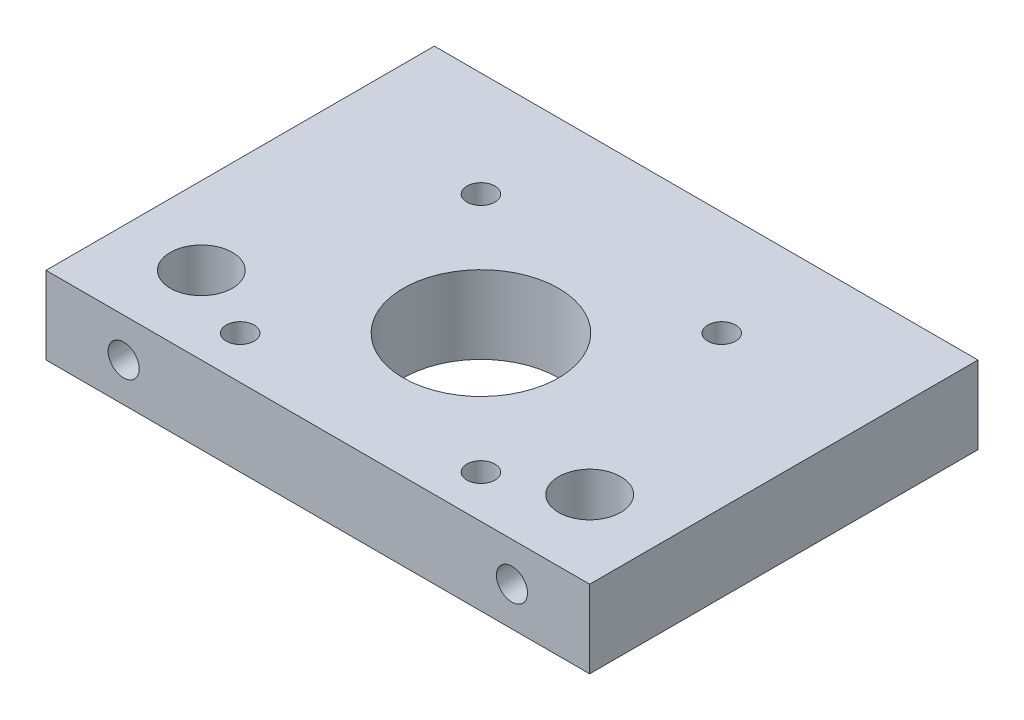
ISO-10303-21;
HEADER;
FILE_DESCRIPTION(('STEP AP214'),'2;1');
FILE_NAME('part.step','',(''),(''),'','','');
FILE_SCHEMA(('AUTOMOTIVE_DESIGN { 1 0 10303 214 1 1 1 1 }'));
ENDSEC;
DATA;
#1=APPLICATION_CONTEXT('core data for automotive mechanical design processes');
#2=APPLICATION_PROTOCOL_DEFINITION('international standard','automotive_design',2000,#1);
#3=PRODUCT_CONTEXT('',#1,'mechanical');
#4=PRODUCT('Part','Part','',(#3));
#5=PRODUCT_RELATED_PRODUCT_CATEGORY('part','',(#4));
#6=PRODUCT_DEFINITION_FORMATION('','',#4);
#7=PRODUCT_DEFINITION_CONTEXT('part definition',#1,'design');
#8=PRODUCT_DEFINITION('design','',#6,#7);
#9=PRODUCT_DEFINITION_SHAPE('','',#8);
#10=(LENGTH_UNIT() NAMED_UNIT(*) SI_UNIT(.MILLI.,.METRE.));
#11=(NAMED_UNIT(*) PLANE_ANGLE_UNIT() SI_UNIT($,.RADIAN.));
#12=(NAMED_UNIT(*) SI_UNIT($,.STERADIAN.) SOLID_ANGLE_UNIT());
#13=UNCERTAINTY_MEASURE_WITH_UNIT(LENGTH_MEASURE(1.E-05),#10,'distance_accuracy_value','');
#14=(GEOMETRIC_REPRESENTATION_CONTEXT(3) GLOBAL_UNCERTAINTY_ASSIGNED_CONTEXT((#13)) GLOBAL_UNIT_ASSIGNED_CONTEXT((#10,
#11,#12)) REPRESENTATION_CONTEXT('',''));
#15=CARTESIAN_POINT('',(0.,0.,0.));
#16=DIRECTION('',(0.,0.,1.));
#17=DIRECTION('',(1.,0.,0.));
#18=AXIS2_PLACEMENT_3D('',#15,#16,#17);
#19=CARTESIAN_POINT('',(-35.,10.,25.));
#20=DIRECTION('',(1.,0.,0.));
#21=DIRECTION('',(0.,0.,-1.));
#22=AXIS2_PLACEMENT_3D('',#19,#20,#21);
#23=PLANE('',#22);
#24=DIRECTION('',(0.,0.,1.));
#25=VECTOR('',#24,1.);
#26=CARTESIAN_POINT('',(-35.,0.,25.));
#27=LINE('',#26,#25);
#28=CARTESIAN_POINT('',(-35.,0.,-25.));
#29=VERTEX_POINT('',#28);
#30=CARTESIAN_POINT('',(-35.,0.,25.));
#31=VERTEX_POINT('',#30);
#32=EDGE_CURVE('E105',#29,#31,#27,.T.);
#33=ORIENTED_EDGE('',*,*,#32,.T.);
#34=DIRECTION('',(0.,-1.,0.));
#35=VECTOR('',#34,1.);
#36=CARTESIAN_POINT('',(-35.,10.,25.));
#37=LINE('',#36,#35);
#38=CARTESIAN_POINT('',(-35.,10.,25.));
#39=VERTEX_POINT('',#38);
#40=EDGE_CURVE('E11',#39,#31,#37,.T.);
#41=ORIENTED_EDGE('',*,*,#40,.F.);
#42=DIRECTION('',(0.,0.,1.));
#43=VECTOR('',#42,1.);
#44=CARTESIAN_POINT('',(-35.,10.,25.));
#45=LINE('',#44,#43);
#46=CARTESIAN_POINT('',(-35.,10.,-25.));
#47=VERTEX_POINT('',#46);
#48=EDGE_CURVE('E92',#47,#39,#45,.T.);
#49=ORIENTED_EDGE('',*,*,#48,.F.);
#50=DIRECTION('',(0.,-1.,0.));
#51=VECTOR('',#50,1.);
#52=CARTESIAN_POINT('',(-35.,10.,-25.));
#53=LINE('',#52,#51);
#54=EDGE_CURVE('E101',#47,#29,#53,.T.);
#55=ORIENTED_EDGE('',*,*,#54,.T.);
#56=EDGE_LOOP('',(#33,#41,#49,#55));
#57=FACE_BOUND('',#56,.T.);
#58=ADVANCED_FACE('F34',(#57),#23,.F.);
#59=CARTESIAN_POINT('',(35.,10.,25.));
#60=DIRECTION('',(0.,0.,-1.));
#61=DIRECTION('',(-1.,0.,0.));
#62=AXIS2_PLACEMENT_3D('',#59,#60,#61);
#63=PLANE('',#62);
#64=CARTESIAN_POINT('',(25.,5.,25.));
#65=DIRECTION('',(0.,0.,1.));
#66=DIRECTION('',(1.,0.,0.));
#67=AXIS2_PLACEMENT_3D('',#64,#65,#66);
#68=CIRCLE('',#67,2.);
#69=CARTESIAN_POINT('',(27.,5.,25.));
#70=VERTEX_POINT('',#69);
#71=EDGE_CURVE('E120',#70,#70,#68,.T.);
#72=ORIENTED_EDGE('',*,*,#71,.F.);
#73=EDGE_LOOP('',(#72));
#74=FACE_BOUND('',#73,.T.);
#75=CARTESIAN_POINT('',(-25.,4.99999999999999,25.));
#76=DIRECTION('',(0.,0.,1.));
#77=DIRECTION('',(-1.,0.,0.));
#78=AXIS2_PLACEMENT_3D('',#75,#76,#77);
#79=CIRCLE('',#78,2.);
#80=CARTESIAN_POINT('',(-27.,4.99999999999999,25.));
#81=VERTEX_POINT('',#80);
#82=EDGE_CURVE('E321',#81,#81,#79,.T.);
#83=ORIENTED_EDGE('',*,*,#82,.F.);
#84=EDGE_LOOP('',(#83));
#85=FACE_BOUND('',#84,.T.);
#86=DIRECTION('',(1.,0.,0.));
#87=VECTOR('',#86,1.);
#88=CARTESIAN_POINT('',(35.,0.,25.));
#89=LINE('',#88,#87);
#90=CARTESIAN_POINT('',(35.,0.,25.));
#91=VERTEX_POINT('',#90);
#92=EDGE_CURVE('E96',#31,#91,#89,.T.);
#93=ORIENTED_EDGE('',*,*,#92,.T.);
#94=DIRECTION('',(0.,-1.,0.));
#95=VECTOR('',#94,1.);
#96=CARTESIAN_POINT('',(35.,10.,25.));
#97=LINE('',#96,#95);
#98=CARTESIAN_POINT('',(35.,10.,25.));
#99=VERTEX_POINT('',#98);
#100=EDGE_CURVE('E48',#99,#91,#97,.T.);
#101=ORIENTED_EDGE('',*,*,#100,.F.);
#102=DIRECTION('',(1.,0.,0.));
#103=VECTOR('',#102,1.);
#104=CARTESIAN_POINT('',(35.,10.,25.));
#105=LINE('',#104,#103);
#106=EDGE_CURVE('E87',#39,#99,#105,.T.);
#107=ORIENTED_EDGE('',*,*,#106,.F.);
#108=ORIENTED_EDGE('',*,*,#40,.T.);
#109=EDGE_LOOP('',(#93,#101,#107,#108));
#110=FACE_BOUND('',#109,.T.);
#111=ADVANCED_FACE('F95',(#74,#85,#110),#63,.F.);
#112=CARTESIAN_POINT('',(35.,10.,25.));
#113=DIRECTION('',(-1.,0.,0.));
#114=DIRECTION('',(0.,0.,1.));
#115=AXIS2_PLACEMENT_3D('',#112,#113,#114);
#116=PLANE('',#115);
#117=DIRECTION('',(0.,0.,-1.));
#118=VECTOR('',#117,1.);
#119=CARTESIAN_POINT('',(35.,0.,25.));
#120=LINE('',#119,#118);
#121=CARTESIAN_POINT('',(35.,0.,-25.));
#122=VERTEX_POINT('',#121);
#123=EDGE_CURVE('E74',#91,#122,#120,.T.);
#124=ORIENTED_EDGE('',*,*,#123,.T.);
#125=DIRECTION('',(0.,-1.,0.));
#126=VECTOR('',#125,1.);
#127=CARTESIAN_POINT('',(35.,10.,-25.));
#128=LINE('',#127,#126);
#129=CARTESIAN_POINT('',(35.,10.,-25.));
#130=VERTEX_POINT('',#129);
#131=EDGE_CURVE('E97',#130,#122,#128,.T.);
#132=ORIENTED_EDGE('',*,*,#131,.F.);
#133=DIRECTION('',(0.,0.,-1.));
#134=VECTOR('',#133,1.);
#135=CARTESIAN_POINT('',(35.,10.,25.));
#136=LINE('',#135,#134);
#137=EDGE_CURVE('E90',#99,#130,#136,.T.);
#138=ORIENTED_EDGE('',*,*,#137,.F.);
#139=ORIENTED_EDGE('',*,*,#100,.T.);
#140=EDGE_LOOP('',(#124,#132,#138,#139));
#141=FACE_BOUND('',#140,.T.);
#142=ADVANCED_FACE('F99',(#141),#116,.F.);
#143=CARTESIAN_POINT('',(35.,10.,-25.));
#144=DIRECTION('',(0.,0.,1.));
#145=DIRECTION('',(1.,0.,0.));
#146=AXIS2_PLACEMENT_3D('',#143,#144,#145);
#147=PLANE('',#146);
#148=DIRECTION('',(-1.,0.,0.));
#149=VECTOR('',#148,1.);
#150=CARTESIAN_POINT('',(35.,0.,-25.));
#151=LINE('',#150,#149);
#152=EDGE_CURVE('E80',#122,#29,#151,.T.);
#153=ORIENTED_EDGE('',*,*,#152,.T.);
#154=ORIENTED_EDGE('',*,*,#54,.F.);
#155=DIRECTION('',(-1.,0.,0.));
#156=VECTOR('',#155,1.);
#157=CARTESIAN_POINT('',(35.,10.,-25.));
#158=LINE('',#157,#156);
#159=EDGE_CURVE('E57',#130,#47,#158,.T.);
#160=ORIENTED_EDGE('',*,*,#159,.F.);
#161=ORIENTED_EDGE('',*,*,#131,.T.);
#162=EDGE_LOOP('',(#153,#154,#160,#161));
#163=FACE_BOUND('',#162,.T.);
#164=ADVANCED_FACE('F173',(#163),#147,.F.);
#165=CARTESIAN_POINT('',(0.,10.,0.));
#166=DIRECTION('',(0.,1.,0.));
#167=DIRECTION('',(0.,0.,1.));
#168=AXIS2_PLACEMENT_3D('',#165,#166,#167);
#169=PLANE('',#168);
#170=CARTESIAN_POINT('',(5.15281762734335E-13,10.,4.));
#171=DIRECTION('',(0.,-1.,0.));
#172=DIRECTION('',(0.,0.,-1.));
#173=AXIS2_PLACEMENT_3D('',#170,#171,#172);
#174=CIRCLE('',#173,10.);
#175=CARTESIAN_POINT('',(5.15281762734335E-13,10.,-6.00000000000001));
#176=VERTEX_POINT('',#175);
#177=EDGE_CURVE('E251',#176,#176,#174,.T.);
#178=ORIENTED_EDGE('',*,*,#177,.T.);
#179=EDGE_LOOP('',(#178));
#180=FACE_BOUND('',#179,.T.);
#181=CARTESIAN_POINT('',(15.5000000000005,10.,19.5));
#182=DIRECTION('',(0.,-1.,0.));
#183=DIRECTION('',(0.,0.,-1.));
#184=AXIS2_PLACEMENT_3D('',#181,#182,#183);
#185=CIRCLE('',#184,1.80000000000002);
#186=CARTESIAN_POINT('',(15.5000000000005,10.,17.7));
#187=VERTEX_POINT('',#186);
#188=EDGE_CURVE('E272',#187,#187,#185,.T.);
#189=ORIENTED_EDGE('',*,*,#188,.T.);
#190=EDGE_LOOP('',(#189));
#191=FACE_BOUND('',#190,.T.);
#192=CARTESIAN_POINT('',(15.5000000000005,10.,-11.5));
#193=DIRECTION('',(0.,-1.,0.));
#194=DIRECTION('',(0.,0.,-1.));
#195=AXIS2_PLACEMENT_3D('',#192,#193,#194);
#196=CIRCLE('',#195,1.80000000000002);
#197=CARTESIAN_POINT('',(15.5000000000005,10.,-13.3));
#198=VERTEX_POINT('',#197);
#199=EDGE_CURVE('E266',#198,#198,#196,.T.);
#200=ORIENTED_EDGE('',*,*,#199,.T.);
#201=EDGE_LOOP('',(#200));
#202=FACE_BOUND('',#201,.T.);
#203=CARTESIAN_POINT('',(-15.4999999999995,10.,-11.5));
#204=DIRECTION('',(0.,-1.,0.));
#205=DIRECTION('',(0.,0.,-1.));
#206=AXIS2_PLACEMENT_3D('',#203,#204,#205);
#207=CIRCLE('',#206,1.80000000000002);
#208=CARTESIAN_POINT('',(-15.4999999999995,10.,-13.3));
#209=VERTEX_POINT('',#208);
#210=EDGE_CURVE('E259',#209,#209,#207,.T.);
#211=ORIENTED_EDGE('',*,*,#210,.T.);
#212=EDGE_LOOP('',(#211));
#213=FACE_BOUND('',#212,.T.);
#214=CARTESIAN_POINT('',(-15.4999999999995,10.,19.5));
#215=DIRECTION('',(0.,-1.,0.));
#216=DIRECTION('',(0.,0.,-1.));
#217=AXIS2_PLACEMENT_3D('',#214,#215,#216);
#218=CIRCLE('',#217,1.80000000000002);
#219=CARTESIAN_POINT('',(-15.4999999999995,10.,17.7));
#220=VERTEX_POINT('',#219);
#221=EDGE_CURVE('E277',#220,#220,#218,.T.);
#222=ORIENTED_EDGE('',*,*,#221,.T.);
#223=EDGE_LOOP('',(#222));
#224=FACE_BOUND('',#223,.T.);
#225=CARTESIAN_POINT('',(-25.,10.,15.));
#226=DIRECTION('',(0.,1.,0.));
#227=DIRECTION('',(0.,0.,1.));
#228=AXIS2_PLACEMENT_3D('',#225,#226,#227);
#229=CIRCLE('',#228,4.);
#230=CARTESIAN_POINT('',(-25.,10.,19.));
#231=VERTEX_POINT('',#230);
#232=EDGE_CURVE('E285',#231,#231,#229,.T.);
#233=ORIENTED_EDGE('',*,*,#232,.F.);
#234=EDGE_LOOP('',(#233));
#235=FACE_BOUND('',#234,.T.);
#236=CARTESIAN_POINT('',(25.,10.,15.));
#237=DIRECTION('',(0.,1.,0.));
#238=DIRECTION('',(0.,0.,-1.));
#239=AXIS2_PLACEMENT_3D('',#236,#237,#238);
#240=CIRCLE('',#239,4.);
#241=CARTESIAN_POINT('',(25.,10.,11.));
#242=VERTEX_POINT('',#241);
#243=EDGE_CURVE('E280',#242,#242,#240,.T.);
#244=ORIENTED_EDGE('',*,*,#243,.F.);
#245=EDGE_LOOP('',(#244));
#246=FACE_BOUND('',#245,.T.);
#247=ORIENTED_EDGE('',*,*,#48,.T.);
#248=ORIENTED_EDGE('',*,*,#106,.T.);
#249=ORIENTED_EDGE('',*,*,#137,.T.);
#250=ORIENTED_EDGE('',*,*,#159,.T.);
#251=EDGE_LOOP('',(#247,#248,#249,#250));
#252=FACE_BOUND('',#251,.T.);
#253=ADVANCED_FACE('F88',(#180,#191,#202,#213,#224,#235,#246,#252),#169,.T.);
#254=CARTESIAN_POINT('',(0.,0.,0.));
#255=DIRECTION('',(0.,1.,0.));
#256=DIRECTION('',(0.,0.,1.));
#257=AXIS2_PLACEMENT_3D('',#254,#255,#256);
#258=PLANE('',#257);
#259=CARTESIAN_POINT('',(5.15281762734335E-13,0.,4.));
#260=DIRECTION('',(0.,-1.,0.));
#261=DIRECTION('',(0.,0.,-1.));
#262=AXIS2_PLACEMENT_3D('',#259,#260,#261);
#263=CIRCLE('',#262,10.);
#264=CARTESIAN_POINT('',(5.15281762734335E-13,0.,-6.00000000000001));
#265=VERTEX_POINT('',#264);
#266=EDGE_CURVE('E249',#265,#265,#263,.T.);
#267=ORIENTED_EDGE('',*,*,#266,.F.);
#268=EDGE_LOOP('',(#267));
#269=FACE_BOUND('',#268,.T.);
#270=CARTESIAN_POINT('',(15.5000000000005,0.,19.5));
#271=DIRECTION('',(0.,-1.,0.));
#272=DIRECTION('',(0.,0.,-1.));
#273=AXIS2_PLACEMENT_3D('',#270,#271,#272);
#274=CIRCLE('',#273,1.80000000000002);
#275=CARTESIAN_POINT('',(15.5000000000005,0.,17.7));
#276=VERTEX_POINT('',#275);
#277=EDGE_CURVE('E255',#276,#276,#274,.T.);
#278=ORIENTED_EDGE('',*,*,#277,.F.);
#279=EDGE_LOOP('',(#278));
#280=FACE_BOUND('',#279,.T.);
#281=CARTESIAN_POINT('',(15.5000000000005,0.,-11.5));
#282=DIRECTION('',(0.,-1.,0.));
#283=DIRECTION('',(0.,0.,-1.));
#284=AXIS2_PLACEMENT_3D('',#281,#282,#283);
#285=CIRCLE('',#284,1.80000000000002);
#286=CARTESIAN_POINT('',(15.5000000000005,0.,-13.3));
#287=VERTEX_POINT('',#286);
#288=EDGE_CURVE('E269',#287,#287,#285,.T.);
#289=ORIENTED_EDGE('',*,*,#288,.F.);
#290=EDGE_LOOP('',(#289));
#291=FACE_BOUND('',#290,.T.);
#292=CARTESIAN_POINT('',(-15.4999999999995,0.,-11.5));
#293=DIRECTION('',(0.,-1.,0.));
#294=DIRECTION('',(0.,0.,-1.));
#295=AXIS2_PLACEMENT_3D('',#292,#293,#294);
#296=CIRCLE('',#295,1.80000000000002);
#297=CARTESIAN_POINT('',(-15.4999999999995,0.,-13.3));
#298=VERTEX_POINT('',#297);
#299=EDGE_CURVE('E263',#298,#298,#296,.T.);
#300=ORIENTED_EDGE('',*,*,#299,.F.);
#301=EDGE_LOOP('',(#300));
#302=FACE_BOUND('',#301,.T.);
#303=CARTESIAN_POINT('',(-15.4999999999995,0.,19.5));
#304=DIRECTION('',(0.,-1.,0.));
#305=DIRECTION('',(0.,0.,-1.));
#306=AXIS2_PLACEMENT_3D('',#303,#304,#305);
#307=CIRCLE('',#306,1.80000000000002);
#308=CARTESIAN_POINT('',(-15.4999999999995,0.,17.7));
#309=VERTEX_POINT('',#308);
#310=EDGE_CURVE('E262',#309,#309,#307,.T.);
#311=ORIENTED_EDGE('',*,*,#310,.F.);
#312=EDGE_LOOP('',(#311));
#313=FACE_BOUND('',#312,.T.);
#314=CARTESIAN_POINT('',(-25.,0.,15.));
#315=DIRECTION('',(0.,1.,0.));
#316=DIRECTION('',(0.,0.,1.));
#317=AXIS2_PLACEMENT_3D('',#314,#315,#316);
#318=CIRCLE('',#317,4.);
#319=CARTESIAN_POINT('',(-25.,0.,19.));
#320=VERTEX_POINT('',#319);
#321=EDGE_CURVE('E108',#320,#320,#318,.T.);
#322=ORIENTED_EDGE('',*,*,#321,.T.);
#323=EDGE_LOOP('',(#322));
#324=FACE_BOUND('',#323,.T.);
#325=CARTESIAN_POINT('',(25.,0.,15.));
#326=DIRECTION('',(0.,1.,0.));
#327=DIRECTION('',(0.,0.,-1.));
#328=AXIS2_PLACEMENT_3D('',#325,#326,#327);
#329=CIRCLE('',#328,4.);
#330=CARTESIAN_POINT('',(25.,0.,11.));
#331=VERTEX_POINT('',#330);
#332=EDGE_CURVE('E288',#331,#331,#329,.T.);
#333=ORIENTED_EDGE('',*,*,#332,.T.);
#334=EDGE_LOOP('',(#333));
#335=FACE_BOUND('',#334,.T.);
#336=ORIENTED_EDGE('',*,*,#32,.F.);
#337=ORIENTED_EDGE('',*,*,#152,.F.);
#338=ORIENTED_EDGE('',*,*,#123,.F.);
#339=ORIENTED_EDGE('',*,*,#92,.F.);
#340=EDGE_LOOP('',(#336,#337,#338,#339));
#341=FACE_BOUND('',#340,.T.);
#342=ADVANCED_FACE('F164',(#269,#280,#291,#302,#313,#324,#335,#341),#258,.F.);
#343=CARTESIAN_POINT('',(25.,0.,15.));
#344=DIRECTION('',(0.,1.,0.));
#345=DIRECTION('',(0.,0.,1.));
#346=AXIS2_PLACEMENT_3D('',#343,#344,#345);
#347=CYLINDRICAL_SURFACE('',#346,4.);
#348=CARTESIAN_POINT('',(25.,3.,19.));
#349=CARTESIAN_POINT('',(25.1051439259025,3.00000660463439,18.9999942681008));
#350=CARTESIAN_POINT('',(25.2104131993951,3.00834014624211,18.9958098203951));
#351=CARTESIAN_POINT('',(25.4178404705378,3.04130576068308,18.9794831207431));
#352=CARTESIAN_POINT('',(25.5199921734273,3.06596878599564,18.9673257565784));
#353=CARTESIAN_POINT('',(25.7178670897609,3.13038761723326,18.9363255880675));
#354=CARTESIAN_POINT('',(25.8136136058783,3.17008476849594,18.9175087835507));
#355=CARTESIAN_POINT('',(25.9969452336132,3.26314124272997,18.8749155303152));
#356=CARTESIAN_POINT('',(26.0845309879801,3.31649948849773,18.8511394726705));
#357=CARTESIAN_POINT('',(26.2550156355238,3.43903449897058,18.7991251651612));
#358=CARTESIAN_POINT('',(26.3373104222442,3.50897295847928,18.7707039825507));
#359=CARTESIAN_POINT('',(26.489558889734,3.66104295849408,18.7131994049349));
#360=CARTESIAN_POINT('',(26.5595031662135,3.74318370354489,18.6841155241807));
#361=CARTESIAN_POINT('',(26.6905040009006,3.92496669904677,18.625979023947));
#362=CARTESIAN_POINT('',(26.7504506711033,4.02547219669183,18.5971037394026));
#363=CARTESIAN_POINT('',(26.8523364537814,4.23673467197244,18.5457195754464));
#364=CARTESIAN_POINT('',(26.8942884299327,4.34748425744551,18.5232061521398));
#365=CARTESIAN_POINT('',(26.9562648843772,4.56933021084385,18.4891573407562));
#366=CARTESIAN_POINT('',(26.9774517141609,4.6800089041348,18.4770454316743));
#367=CARTESIAN_POINT('',(27.0008539866177,4.90395767555896,18.4636377989706));
#368=CARTESIAN_POINT('',(27.0030881767462,5.01722508174232,18.4623313868658));
#369=CARTESIAN_POINT('',(26.9893745743446,5.22857204863074,18.470218605145));
#370=CARTESIAN_POINT('',(26.9755691190736,5.32684806244611,18.4781752732403));
#371=CARTESIAN_POINT('',(26.9338796981139,5.51944381874609,18.501524574677));
#372=CARTESIAN_POINT('',(26.9059912477953,5.61376229061064,18.5169195766355));
#373=CARTESIAN_POINT('',(26.836419560772,5.79845826513133,18.5537495282548));
#374=CARTESIAN_POINT('',(26.794430134232,5.88869279757159,18.57531681328));
#375=CARTESIAN_POINT('',(26.698083375336,6.06126858518002,18.6220680856281));
#376=CARTESIAN_POINT('',(26.6437204876249,6.14360627120019,18.6472536956038));
#377=CARTESIAN_POINT('',(26.5161321098256,6.30904250548646,18.7022631580657));
#378=CARTESIAN_POINT('',(26.4413889167386,6.39091374715232,18.7322702047349));
#379=CARTESIAN_POINT('',(26.2791111574827,6.54147083718181,18.7909524660082));
#380=CARTESIAN_POINT('',(26.1915705131486,6.61015038406777,18.819627039176));
#381=CARTESIAN_POINT('',(26.0010330116637,6.73537132205946,18.8740397456593));
#382=CARTESIAN_POINT('',(25.8975071831988,6.79120094489148,18.8995796832401));
#383=CARTESIAN_POINT('',(25.6809324309776,6.88419405808602,18.9431576224248));
#384=CARTESIAN_POINT('',(25.5678911525305,6.92137237003034,18.9612015788711));
#385=CARTESIAN_POINT('',(25.3455329833214,6.97295080743335,18.9864866748287));
#386=CARTESIAN_POINT('',(25.2366830610966,6.98898247149356,18.9944987660262));
#387=CARTESIAN_POINT('',(25.0175591998987,7.00292946226897,19.0014602691821));
#388=CARTESIAN_POINT('',(24.9072859602602,7.00085337127894,19.0004139744264));
#389=CARTESIAN_POINT('',(24.697534056028,6.97958662316251,18.9898238450687));
#390=CARTESIAN_POINT('',(24.5978811839001,6.96173493454001,18.9809449137634));
#391=CARTESIAN_POINT('',(24.4031862153961,6.91152385620975,18.9564434262968));
#392=CARTESIAN_POINT('',(24.3081446286178,6.87916286709301,18.9408201266882));
#393=CARTESIAN_POINT('',(24.1222227831008,6.80000306713393,18.9036850282718));
#394=CARTESIAN_POINT('',(24.0315392059884,6.75281789976742,18.8820176353926));
#395=CARTESIAN_POINT('',(23.8590772766015,6.64578492870686,18.8348794863483));
#396=CARTESIAN_POINT('',(23.7773027404468,6.5859317308092,18.8094071113388));
#397=CARTESIAN_POINT('',(23.6164646214216,6.44847914933856,18.754164426724));
#398=CARTESIAN_POINT('',(23.5384558443619,6.3697142631097,18.72421769687));
#399=CARTESIAN_POINT('',(23.3962873577623,6.20014969744454,18.6652478321764));
#400=CARTESIAN_POINT('',(23.3321372285763,6.10934176230415,18.6362253480009));
#401=CARTESIAN_POINT('',(23.216584171042,5.91271269165404,18.5810238441298));
#402=CARTESIAN_POINT('',(23.1659490083995,5.80637746781103,18.5550505917812));
#403=CARTESIAN_POINT('',(23.0838343481306,5.58497986485006,18.5114814458827));
#404=CARTESIAN_POINT('',(23.052330168266,5.46992894706621,18.493874764435));
#405=CARTESIAN_POINT('',(23.0122766250663,5.24617955423058,18.471230020516));
#406=CARTESIAN_POINT('',(23.0018140071891,5.13793149312951,18.4651476693013));
#407=CARTESIAN_POINT('',(22.9986216912476,4.92110586567094,18.4633070928321));
#408=CARTESIAN_POINT('',(23.0058843067535,4.81252846252427,18.4675443925278));
#409=CARTESIAN_POINT('',(23.0361477488134,4.60903299693312,18.4847572410215));
#410=CARTESIAN_POINT('',(23.0575833713139,4.51379905971051,18.4968618896532));
#411=CARTESIAN_POINT('',(23.1136492835512,4.32838376115126,18.527420323753));
#412=CARTESIAN_POINT('',(23.1482838176802,4.23820403581593,18.5458761513934));
#413=CARTESIAN_POINT('',(23.2323685093989,4.05875029802692,18.5885706072907));
#414=CARTESIAN_POINT('',(23.2826577243686,3.96994419634194,18.6131144479184));
#415=CARTESIAN_POINT('',(23.3956980567252,3.80145092763748,18.6647066326972));
#416=CARTESIAN_POINT('',(23.4584556575169,3.72176853895777,18.6917562759122));
#417=CARTESIAN_POINT('',(23.6035933466773,3.56371603529064,18.7492464631618));
#418=CARTESIAN_POINT('',(23.6874311540055,3.48668179529941,18.7796996661326));
#419=CARTESIAN_POINT('',(23.8676903875336,3.34747403312946,18.8375550451986));
#420=CARTESIAN_POINT('',(23.9641185533896,3.28530852106018,18.8649555725239));
#421=CARTESIAN_POINT('',(24.1681368064341,3.17752727457586,18.9139601913307));
#422=CARTESIAN_POINT('',(24.2758009924466,3.13203166152706,18.9355219298787));
#423=CARTESIAN_POINT('',(24.4985157977238,3.06038366448518,18.9700268259797));
#424=CARTESIAN_POINT('',(24.6135444008218,3.03417630638857,18.9829944672614));
#425=CARTESIAN_POINT('',(24.7747961070182,3.01220517782852,18.9939092382696));
#426=CARTESIAN_POINT('',(24.8196762411169,3.00763471826732,18.996187306805));
#427=CARTESIAN_POINT('',(24.9096965363898,3.00153066897183,18.9992339395363));
#428=CARTESIAN_POINT('',(24.9548367047068,2.99999716305958,19.0000024620676));
#429=CARTESIAN_POINT('',(25.,3.,19.));
#430=B_SPLINE_CURVE_WITH_KNOTS('',3,(#348,#349,#350,#351,#352,#353,#354,#355,#356,#357,#358,
#359,#360,#361,#362,#363,#364,#365,#366,#367,#368,#369,#370,#371,#372,#373,#374,#375,#376,#377,
#378,#379,#380,#381,#382,#383,#384,#385,#386,#387,#388,#389,#390,#391,#392,#393,#394,#395,#396,
#397,#398,#399,#400,#401,#402,#403,#404,#405,#406,#407,#408,#409,#410,#411,#412,#413,#414,#415,
#416,#417,#418,#419,#420,#421,#422,#423,#424,#425,#426,#427,#428,#429),.UNSPECIFIED.,.T.,.F.,(4,
2,2,2,2,2,2,2,2,2,2,2,2,2,2,2,2,2,2,2,2,2,2,2,2,2,2,2,2,2,2,2,2,2,2,2,2,2,2,2,4),(0.,
0.315248514840586,0.631096299418395,0.945724310984595,1.26032752116313,1.59396351743618,
1.92785247530807,2.28763452861505,2.64715895796561,2.98516024280459,3.3228271465804,
3.62011424818641,3.91749607851356,4.22180480336974,4.52625042520443,4.86929882667757,
5.21251069197373,5.57166044428881,5.93052433824559,6.25966580942691,6.58865129022951,
6.89213813012243,7.19565843261863,7.50785712055797,7.82018901496678,8.16319221288837,
8.50643177230863,8.86629364323451,9.22569023890901,9.55058615006092,9.87534119729356,
10.1691586049771,10.463070575767,10.7767291356057,11.0905512228726,11.4425048551434,
11.7946476676249,12.1492802732705,12.502898172423,12.6383056026783,12.7737167702213),.UNSPECIFIED.);
#431=CARTESIAN_POINT('',(25.,3.,19.));
#432=VERTEX_POINT('',#431);
#433=EDGE_CURVE('E37',#432,#432,#430,.T.);
#434=ORIENTED_EDGE('',*,*,#433,.T.);
#435=EDGE_LOOP('',(#434));
#436=FACE_BOUND('',#435,.T.);
#437=ORIENTED_EDGE('',*,*,#332,.F.);
#438=EDGE_LOOP('',(#437));
#439=FACE_BOUND('',#438,.T.);
#440=ORIENTED_EDGE('',*,*,#243,.T.);
#441=EDGE_LOOP('',(#440));
#442=FACE_BOUND('',#441,.T.);
#443=ADVANCED_FACE('F152',(#436,#439,#442),#347,.F.);
#444=CARTESIAN_POINT('',(-25.,0.,15.));
#445=DIRECTION('',(0.,1.,0.));
#446=DIRECTION('',(0.,0.,1.));
#447=AXIS2_PLACEMENT_3D('',#444,#445,#446);
#448=CYLINDRICAL_SURFACE('',#447,4.);
#449=CARTESIAN_POINT('',(-25.,3.,19.));
#450=CARTESIAN_POINT('',(-24.8948560740975,3.00000660463438,18.9999942681008));
#451=CARTESIAN_POINT('',(-24.7895868006049,3.00834014624211,18.9958098203951));
#452=CARTESIAN_POINT('',(-24.5821595294622,3.04130576068307,18.9794831207431));
#453=CARTESIAN_POINT('',(-24.4800078265727,3.06596878599563,18.9673257565784));
#454=CARTESIAN_POINT('',(-24.2821329102391,3.13038761723325,18.9363255880675));
#455=CARTESIAN_POINT('',(-24.1863863941217,3.17008476849593,18.9175087835508));
#456=CARTESIAN_POINT('',(-24.0030547663868,3.26314124272997,18.8749155303152));
#457=CARTESIAN_POINT('',(-23.9154690120199,3.31649948849772,18.8511394726705));
#458=CARTESIAN_POINT('',(-23.7449843644762,3.43903449897057,18.7991251651612));
#459=CARTESIAN_POINT('',(-23.6626895777558,3.50897295847927,18.7707039825507));
#460=CARTESIAN_POINT('',(-23.510441110266,3.66104295849407,18.7131994049349));
#461=CARTESIAN_POINT('',(-23.4404968337865,3.74318370354487,18.6841155241807));
#462=CARTESIAN_POINT('',(-23.3094959990994,3.92496669904675,18.625979023947));
#463=CARTESIAN_POINT('',(-23.2495493288967,4.02547219669182,18.5971037394026));
#464=CARTESIAN_POINT('',(-23.1476635462186,4.23673467197242,18.5457195754464));
#465=CARTESIAN_POINT('',(-23.1057115700673,4.34748425744549,18.5232061521398));
#466=CARTESIAN_POINT('',(-23.0437351156228,4.56933021084384,18.4891573407562));
#467=CARTESIAN_POINT('',(-23.0225482858391,4.68000890413478,18.4770454316743));
#468=CARTESIAN_POINT('',(-22.9991460133823,4.90395767555895,18.4636377989706));
#469=CARTESIAN_POINT('',(-22.9969118232539,5.0172250817423,18.4623313868658));
#470=CARTESIAN_POINT('',(-23.0106254256554,5.22857204863073,18.470218605145));
#471=CARTESIAN_POINT('',(-23.0244308809264,5.32684806244609,18.4781752732403));
#472=CARTESIAN_POINT('',(-23.0661203018861,5.51944381874607,18.501524574677));
#473=CARTESIAN_POINT('',(-23.0940087522047,5.61376229061062,18.5169195766355));
#474=CARTESIAN_POINT('',(-23.163580439228,5.79845826513131,18.5537495282548));
#475=CARTESIAN_POINT('',(-23.205569865768,5.88869279757157,18.57531681328));
#476=CARTESIAN_POINT('',(-23.301916624664,6.06126858518,18.6220680856281));
#477=CARTESIAN_POINT('',(-23.3562795123751,6.14360627120017,18.6472536956038));
#478=CARTESIAN_POINT('',(-23.4838678901744,6.30904250548644,18.7022631580657));
#479=CARTESIAN_POINT('',(-23.5586110832614,6.3909137471523,18.7322702047349));
#480=CARTESIAN_POINT('',(-23.7208888425173,6.54147083718179,18.7909524660082));
#481=CARTESIAN_POINT('',(-23.8084294868514,6.61015038406776,18.819627039176));
#482=CARTESIAN_POINT('',(-23.9989669883363,6.73537132205944,18.8740397456593));
#483=CARTESIAN_POINT('',(-24.1024928168012,6.79120094489147,18.8995796832401));
#484=CARTESIAN_POINT('',(-24.3190675690224,6.88419405808601,18.9431576224248));
#485=CARTESIAN_POINT('',(-24.4321088474694,6.92137237003032,18.9612015788711));
#486=CARTESIAN_POINT('',(-24.6544670166786,6.97295080743334,18.9864866748287));
#487=CARTESIAN_POINT('',(-24.7633169389033,6.98898247149355,18.9944987660262));
#488=CARTESIAN_POINT('',(-24.9824408001013,7.00292946226896,19.0014602691821));
#489=CARTESIAN_POINT('',(-25.0927140397398,7.00085337127893,19.0004139744264));
#490=CARTESIAN_POINT('',(-25.302465943972,6.9795866231625,18.9898238450687));
#491=CARTESIAN_POINT('',(-25.4021188160999,6.96173493454,18.9809449137634));
#492=CARTESIAN_POINT('',(-25.5968137846039,6.91152385620975,18.9564434262968));
#493=CARTESIAN_POINT('',(-25.6918553713822,6.879162867093,18.9408201266882));
#494=CARTESIAN_POINT('',(-25.8777772168991,6.80000306713393,18.9036850282718));
#495=CARTESIAN_POINT('',(-25.9684607940116,6.75281789976742,18.8820176353926));
#496=CARTESIAN_POINT('',(-26.1409227233985,6.64578492870686,18.8348794863484));
#497=CARTESIAN_POINT('',(-26.2226972595532,6.5859317308092,18.8094071113388));
#498=CARTESIAN_POINT('',(-26.3835353785784,6.44847914933856,18.754164426724));
#499=CARTESIAN_POINT('',(-26.461544155638,6.3697142631097,18.72421769687));
#500=CARTESIAN_POINT('',(-26.6037126422377,6.20014969744454,18.6652478321764));
#501=CARTESIAN_POINT('',(-26.6678627714237,6.10934176230415,18.6362253480009));
#502=CARTESIAN_POINT('',(-26.783415828958,5.91271269165404,18.5810238441298));
#503=CARTESIAN_POINT('',(-26.8340509916005,5.80637746781103,18.5550505917812));
#504=CARTESIAN_POINT('',(-26.9161656518694,5.58497986485006,18.5114814458827));
#505=CARTESIAN_POINT('',(-26.947669831734,5.46992894706622,18.493874764435));
#506=CARTESIAN_POINT('',(-26.9877233749337,5.24617955423059,18.471230020516));
#507=CARTESIAN_POINT('',(-26.9981859928109,5.13793149312951,18.4651476693013));
#508=CARTESIAN_POINT('',(-27.0013783087524,4.92110586567095,18.4633070928321));
#509=CARTESIAN_POINT('',(-26.9941156932465,4.81252846252427,18.4675443925278));
#510=CARTESIAN_POINT('',(-26.9638522511866,4.60903299693312,18.4847572410215));
#511=CARTESIAN_POINT('',(-26.9424166286861,4.51379905971052,18.4968618896532));
#512=CARTESIAN_POINT('',(-26.8863507164488,4.32838376115126,18.5274203237531));
#513=CARTESIAN_POINT('',(-26.8517161823198,4.23820403581593,18.5458761513934));
#514=CARTESIAN_POINT('',(-26.7676314906011,4.05875029802692,18.5885706072907));
#515=CARTESIAN_POINT('',(-26.7173422756314,3.96994419634194,18.6131144479184));
#516=CARTESIAN_POINT('',(-26.6043019432748,3.80145092763748,18.6647066326972));
#517=CARTESIAN_POINT('',(-26.5415443424831,3.72176853895778,18.6917562759122));
#518=CARTESIAN_POINT('',(-26.3964066533227,3.56371603529065,18.7492464631618));
#519=CARTESIAN_POINT('',(-26.3125688459945,3.48668179529942,18.7796996661326));
#520=CARTESIAN_POINT('',(-26.1323096124664,3.34747403312946,18.8375550451986));
#521=CARTESIAN_POINT('',(-26.0358814466104,3.28530852106019,18.8649555725239));
#522=CARTESIAN_POINT('',(-25.8318631935659,3.17752727457586,18.9139601913308));
#523=CARTESIAN_POINT('',(-25.7241990075535,3.13203166152706,18.9355219298787));
#524=CARTESIAN_POINT('',(-25.5014842022762,3.06038366448518,18.9700268259797));
#525=CARTESIAN_POINT('',(-25.3864555991782,3.03417630638857,18.9829944672614));
#526=CARTESIAN_POINT('',(-25.2252038929818,3.01220517782852,18.9939092382696));
#527=CARTESIAN_POINT('',(-25.1803237588831,3.00763471826732,18.996187306805));
#528=CARTESIAN_POINT('',(-25.0903034636102,3.00153066897183,18.9992339395363));
#529=CARTESIAN_POINT('',(-25.0451632952933,2.99999716305958,19.0000024620676));
#530=CARTESIAN_POINT('',(-25.,3.,19.));
#531=B_SPLINE_CURVE_WITH_KNOTS('',3,(#449,#450,#451,#452,#453,#454,#455,#456,#457,#458,#459,
#460,#461,#462,#463,#464,#465,#466,#467,#468,#469,#470,#471,#472,#473,#474,#475,#476,#477,#478,
#479,#480,#481,#482,#483,#484,#485,#486,#487,#488,#489,#490,#491,#492,#493,#494,#495,#496,#497,
#498,#499,#500,#501,#502,#503,#504,#505,#506,#507,#508,#509,#510,#511,#512,#513,#514,#515,#516,
#517,#518,#519,#520,#521,#522,#523,#524,#525,#526,#527,#528,#529,#530),.UNSPECIFIED.,.T.,.F.,(4,
2,2,2,2,2,2,2,2,2,2,2,2,2,2,2,2,2,2,2,2,2,2,2,2,2,2,2,2,2,2,2,2,2,2,2,2,2,2,2,4),(0.,
0.315248514840582,0.631096299418394,0.945724310984594,1.26032752116313,1.59396351743617,
1.92785247530806,2.28763452861505,2.64715895796561,2.98516024280459,3.3228271465804,
3.6201142481864,3.91749607851356,4.22180480336974,4.52625042520443,4.86929882667756,
5.21251069197372,5.5716604442888,5.93052433824558,6.2596658094269,6.5886512902295,
6.89213813012242,7.19565843261861,7.50785712055795,7.82018901496677,8.16319221288836,
8.50643177230862,8.86629364323449,9.22569023890899,9.55058615006091,9.87534119729355,
10.1691586049771,10.463070575767,10.7767291356057,11.0905512228726,11.4425048551434,
11.7946476676249,12.1492802732705,12.502898172423,12.6383056026783,12.7737167702213),.UNSPECIFIED.);
#532=CARTESIAN_POINT('',(-25.,3.,19.));
#533=VERTEX_POINT('',#532);
#534=EDGE_CURVE('E113',#533,#533,#531,.T.);
#535=ORIENTED_EDGE('',*,*,#534,.T.);
#536=EDGE_LOOP('',(#535));
#537=FACE_BOUND('',#536,.T.);
#538=ORIENTED_EDGE('',*,*,#321,.F.);
#539=EDGE_LOOP('',(#538));
#540=FACE_BOUND('',#539,.T.);
#541=ORIENTED_EDGE('',*,*,#232,.T.);
#542=EDGE_LOOP('',(#541));
#543=FACE_BOUND('',#542,.T.);
#544=ADVANCED_FACE('F121',(#537,#540,#543),#448,.F.);
#545=CARTESIAN_POINT('',(-15.4999999999995,10.,19.5));
#546=DIRECTION('',(0.,-1.,0.));
#547=DIRECTION('',(0.,0.,-1.));
#548=AXIS2_PLACEMENT_3D('',#545,#546,#547);
#549=CYLINDRICAL_SURFACE('',#548,1.80000000000002);
#550=ORIENTED_EDGE('',*,*,#221,.F.);
#551=EDGE_LOOP('',(#550));
#552=FACE_BOUND('',#551,.T.);
#553=ORIENTED_EDGE('',*,*,#310,.T.);
#554=EDGE_LOOP('',(#553));
#555=FACE_BOUND('',#554,.T.);
#556=ADVANCED_FACE('F140',(#552,#555),#549,.F.);
#557=CARTESIAN_POINT('',(-15.4999999999995,10.,-11.5));
#558=DIRECTION('',(0.,-1.,0.));
#559=DIRECTION('',(0.,0.,-1.));
#560=AXIS2_PLACEMENT_3D('',#557,#558,#559);
#561=CYLINDRICAL_SURFACE('',#560,1.80000000000002);
#562=ORIENTED_EDGE('',*,*,#210,.F.);
#563=EDGE_LOOP('',(#562));
#564=FACE_BOUND('',#563,.T.);
#565=ORIENTED_EDGE('',*,*,#299,.T.);
#566=EDGE_LOOP('',(#565));
#567=FACE_BOUND('',#566,.T.);
#568=ADVANCED_FACE('F136',(#564,#567),#561,.F.);
#569=CARTESIAN_POINT('',(15.5000000000005,10.,-11.5));
#570=DIRECTION('',(0.,-1.,0.));
#571=DIRECTION('',(0.,0.,-1.));
#572=AXIS2_PLACEMENT_3D('',#569,#570,#571);
#573=CYLINDRICAL_SURFACE('',#572,1.80000000000002);
#574=ORIENTED_EDGE('',*,*,#199,.F.);
#575=EDGE_LOOP('',(#574));
#576=FACE_BOUND('',#575,.T.);
#577=ORIENTED_EDGE('',*,*,#288,.T.);
#578=EDGE_LOOP('',(#577));
#579=FACE_BOUND('',#578,.T.);
#580=ADVANCED_FACE('F139',(#576,#579),#573,.F.);
#581=CARTESIAN_POINT('',(15.5000000000005,10.,19.5));
#582=DIRECTION('',(0.,-1.,0.));
#583=DIRECTION('',(0.,0.,-1.));
#584=AXIS2_PLACEMENT_3D('',#581,#582,#583);
#585=CYLINDRICAL_SURFACE('',#584,1.80000000000002);
#586=ORIENTED_EDGE('',*,*,#188,.F.);
#587=EDGE_LOOP('',(#586));
#588=FACE_BOUND('',#587,.T.);
#589=ORIENTED_EDGE('',*,*,#277,.T.);
#590=EDGE_LOOP('',(#589));
#591=FACE_BOUND('',#590,.T.);
#592=ADVANCED_FACE('F134',(#588,#591),#585,.F.);
#593=CARTESIAN_POINT('',(5.15281762734335E-13,10.,4.));
#594=DIRECTION('',(0.,-1.,0.));
#595=DIRECTION('',(0.,0.,-1.));
#596=AXIS2_PLACEMENT_3D('',#593,#594,#595);
#597=CYLINDRICAL_SURFACE('',#596,10.);
#598=ORIENTED_EDGE('',*,*,#177,.F.);
#599=EDGE_LOOP('',(#598));
#600=FACE_BOUND('',#599,.T.);
#601=ORIENTED_EDGE('',*,*,#266,.T.);
#602=EDGE_LOOP('',(#601));
#603=FACE_BOUND('',#602,.T.);
#604=ADVANCED_FACE('F129',(#600,#603),#597,.F.);
#605=CARTESIAN_POINT('',(-25.,4.99999999999999,15.));
#606=DIRECTION('',(0.,0.,1.));
#607=DIRECTION('',(1.,0.,0.));
#608=AXIS2_PLACEMENT_3D('',#605,#606,#607);
#609=CYLINDRICAL_SURFACE('',#608,2.);
#610=ORIENTED_EDGE('',*,*,#82,.T.);
#611=EDGE_LOOP('',(#610));
#612=FACE_BOUND('',#611,.T.);
#613=ORIENTED_EDGE('',*,*,#534,.F.);
#614=EDGE_LOOP('',(#613));
#615=FACE_BOUND('',#614,.T.);
#616=ADVANCED_FACE('F124',(#612,#615),#609,.F.);
#617=CARTESIAN_POINT('',(25.,5.,15.));
#618=DIRECTION('',(0.,0.,1.));
#619=DIRECTION('',(1.,0.,0.));
#620=AXIS2_PLACEMENT_3D('',#617,#618,#619);
#621=CYLINDRICAL_SURFACE('',#620,2.);
#622=ORIENTED_EDGE('',*,*,#71,.T.);
#623=EDGE_LOOP('',(#622));
#624=FACE_BOUND('',#623,.T.);
#625=ORIENTED_EDGE('',*,*,#433,.F.);
#626=EDGE_LOOP('',(#625));
#627=FACE_BOUND('',#626,.T.);
#628=ADVANCED_FACE('F128',(#624,#627),#621,.F.);
#629=CLOSED_SHELL('',(#58,#111,#142,#164,#253,#342,#443,#544,#556,#568,#580,#592,#604,#616,#628));
#630=MANIFOLD_SOLID_BREP('B2',#629);
#631=ADVANCED_BREP_SHAPE_REPRESENTATION('',(#18,#630),#14);
#632=SHAPE_DEFINITION_REPRESENTATION(#9,#631);
ENDSEC;
END-ISO-10303-21;
